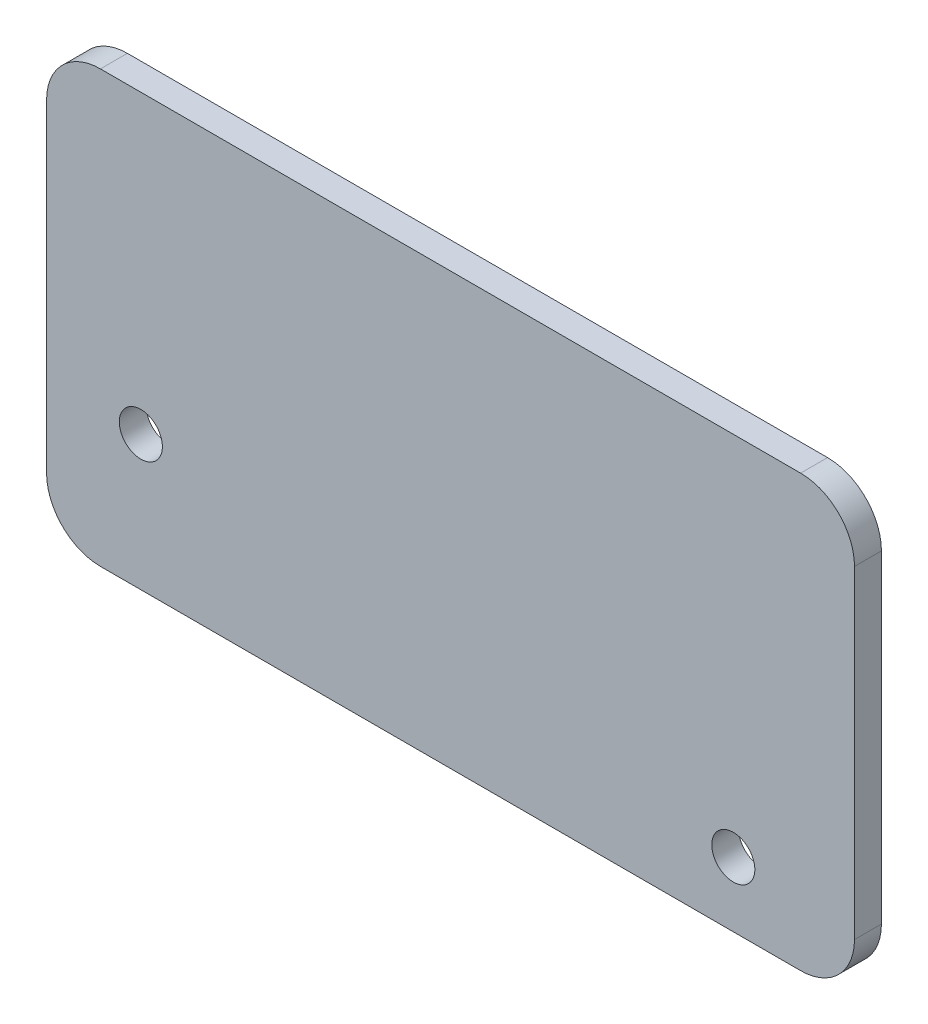
ISO-10303-21;
HEADER;
FILE_DESCRIPTION(('STEP AP214'),'2;1');
FILE_NAME('part.step','',(''),(''),'','','');
FILE_SCHEMA(('AUTOMOTIVE_DESIGN { 1 0 10303 214 1 1 1 1 }'));
ENDSEC;
DATA;
#1=APPLICATION_CONTEXT('core data for automotive mechanical design processes');
#2=APPLICATION_PROTOCOL_DEFINITION('international standard','automotive_design',2000,#1);
#3=PRODUCT_CONTEXT('',#1,'mechanical');
#4=PRODUCT('Part','Part','',(#3));
#5=PRODUCT_RELATED_PRODUCT_CATEGORY('part','',(#4));
#6=PRODUCT_DEFINITION_FORMATION('','',#4);
#7=PRODUCT_DEFINITION_CONTEXT('part definition',#1,'design');
#8=PRODUCT_DEFINITION('design','',#6,#7);
#9=PRODUCT_DEFINITION_SHAPE('','',#8);
#10=(LENGTH_UNIT() NAMED_UNIT(*) SI_UNIT(.MILLI.,.METRE.));
#11=(NAMED_UNIT(*) PLANE_ANGLE_UNIT() SI_UNIT($,.RADIAN.));
#12=(NAMED_UNIT(*) SI_UNIT($,.STERADIAN.) SOLID_ANGLE_UNIT());
#13=UNCERTAINTY_MEASURE_WITH_UNIT(LENGTH_MEASURE(1.E-05),#10,'distance_accuracy_value','');
#14=(GEOMETRIC_REPRESENTATION_CONTEXT(3) GLOBAL_UNCERTAINTY_ASSIGNED_CONTEXT((#13)) GLOBAL_UNIT_ASSIGNED_CONTEXT((#10,
#11,#12)) REPRESENTATION_CONTEXT('',''));
#15=CARTESIAN_POINT('',(0.,0.,0.));
#16=DIRECTION('',(0.,0.,1.));
#17=DIRECTION('',(1.,0.,0.));
#18=AXIS2_PLACEMENT_3D('',#15,#16,#17);
#19=CARTESIAN_POINT('',(65.,30.,5.));
#20=DIRECTION('',(0.,0.,1.));
#21=DIRECTION('',(1.,0.,0.));
#22=AXIS2_PLACEMENT_3D('',#19,#20,#21);
#23=PLANE('',#22);
#24=CARTESIAN_POINT('',(52.5,-28.,5.));
#25=DIRECTION('',(0.,0.,1.));
#26=DIRECTION('',(1.,0.,0.));
#27=AXIS2_PLACEMENT_3D('',#24,#25,#26);
#28=CIRCLE('',#27,4.00000000000001);
#29=CARTESIAN_POINT('',(56.5,-28.,5.));
#30=VERTEX_POINT('',#29);
#31=EDGE_CURVE('E136',#30,#30,#28,.T.);
#32=ORIENTED_EDGE('',*,*,#31,.F.);
#33=EDGE_LOOP('',(#32));
#34=FACE_BOUND('',#33,.T.);
#35=CARTESIAN_POINT('',(65.,30.,5.));
#36=DIRECTION('',(0.,0.,1.));
#37=DIRECTION('',(1.,0.,0.));
#38=AXIS2_PLACEMENT_3D('',#35,#36,#37);
#39=CIRCLE('',#38,9.99999999999999);
#40=CARTESIAN_POINT('',(75.,30.,5.));
#41=VERTEX_POINT('',#40);
#42=CARTESIAN_POINT('',(65.,40.,5.));
#43=VERTEX_POINT('',#42);
#44=EDGE_CURVE('E147',#41,#43,#39,.T.);
#45=ORIENTED_EDGE('',*,*,#44,.T.);
#46=DIRECTION('',(-1.,0.,0.));
#47=VECTOR('',#46,1.);
#48=CARTESIAN_POINT('',(-65.,40.,5.));
#49=LINE('',#48,#47);
#50=CARTESIAN_POINT('',(-65.,40.,5.));
#51=VERTEX_POINT('',#50);
#52=EDGE_CURVE('E95',#43,#51,#49,.T.);
#53=ORIENTED_EDGE('',*,*,#52,.T.);
#54=CARTESIAN_POINT('',(-65.,30.,5.));
#55=DIRECTION('',(0.,0.,1.));
#56=DIRECTION('',(-1.,0.,0.));
#57=AXIS2_PLACEMENT_3D('',#54,#55,#56);
#58=CIRCLE('',#57,9.99999999999999);
#59=CARTESIAN_POINT('',(-75.,30.,5.));
#60=VERTEX_POINT('',#59);
#61=EDGE_CURVE('E162',#51,#60,#58,.T.);
#62=ORIENTED_EDGE('',*,*,#61,.T.);
#63=DIRECTION('',(0.,-1.,0.));
#64=VECTOR('',#63,1.);
#65=CARTESIAN_POINT('',(-75.,30.,5.));
#66=LINE('',#65,#64);
#67=CARTESIAN_POINT('',(-75.,-30.,5.));
#68=VERTEX_POINT('',#67);
#69=EDGE_CURVE('E175',#60,#68,#66,.T.);
#70=ORIENTED_EDGE('',*,*,#69,.T.);
#71=CARTESIAN_POINT('',(-65.,-30.,5.));
#72=DIRECTION('',(0.,0.,1.));
#73=DIRECTION('',(-1.,0.,0.));
#74=AXIS2_PLACEMENT_3D('',#71,#72,#73);
#75=CIRCLE('',#74,9.99999999999999);
#76=CARTESIAN_POINT('',(-65.,-40.,5.));
#77=VERTEX_POINT('',#76);
#78=EDGE_CURVE('E114',#68,#77,#75,.T.);
#79=ORIENTED_EDGE('',*,*,#78,.T.);
#80=DIRECTION('',(1.,0.,0.));
#81=VECTOR('',#80,1.);
#82=CARTESIAN_POINT('',(-65.,-40.,5.));
#83=LINE('',#82,#81);
#84=CARTESIAN_POINT('',(65.,-40.,5.));
#85=VERTEX_POINT('',#84);
#86=EDGE_CURVE('E108',#77,#85,#83,.T.);
#87=ORIENTED_EDGE('',*,*,#86,.T.);
#88=CARTESIAN_POINT('',(65.,-30.,5.));
#89=DIRECTION('',(0.,0.,1.));
#90=DIRECTION('',(1.,0.,0.));
#91=AXIS2_PLACEMENT_3D('',#88,#89,#90);
#92=CIRCLE('',#91,10.);
#93=CARTESIAN_POINT('',(75.,-30.,5.));
#94=VERTEX_POINT('',#93);
#95=EDGE_CURVE('E112',#85,#94,#92,.T.);
#96=ORIENTED_EDGE('',*,*,#95,.T.);
#97=DIRECTION('',(0.,1.,0.));
#98=VECTOR('',#97,1.);
#99=CARTESIAN_POINT('',(75.,30.,5.));
#100=LINE('',#99,#98);
#101=EDGE_CURVE('E52',#94,#41,#100,.T.);
#102=ORIENTED_EDGE('',*,*,#101,.T.);
#103=EDGE_LOOP('',(#45,#53,#62,#70,#79,#87,#96,#102));
#104=FACE_BOUND('',#103,.T.);
#105=CARTESIAN_POINT('',(-57.500017929212,-14.9999999999999,5.));
#106=DIRECTION('',(0.,0.,1.));
#107=DIRECTION('',(1.,0.,0.));
#108=AXIS2_PLACEMENT_3D('',#105,#106,#107);
#109=CIRCLE('',#108,4.00000000000001);
#110=CARTESIAN_POINT('',(-53.500017929212,-14.9999999999999,5.));
#111=VERTEX_POINT('',#110);
#112=EDGE_CURVE('E184',#111,#111,#109,.T.);
#113=ORIENTED_EDGE('',*,*,#112,.F.);
#114=EDGE_LOOP('',(#113));
#115=FACE_BOUND('',#114,.T.);
#116=ADVANCED_FACE('F35',(#34,#104,#115),#23,.T.);
#117=CARTESIAN_POINT('',(65.,30.,0.));
#118=DIRECTION('',(0.,0.,1.));
#119=DIRECTION('',(1.,0.,0.));
#120=AXIS2_PLACEMENT_3D('',#117,#118,#119);
#121=PLANE('',#120);
#122=CARTESIAN_POINT('',(65.,30.,0.));
#123=DIRECTION('',(0.,0.,1.));
#124=DIRECTION('',(1.,0.,0.));
#125=AXIS2_PLACEMENT_3D('',#122,#123,#124);
#126=CIRCLE('',#125,9.99999999999999);
#127=CARTESIAN_POINT('',(75.,30.,0.));
#128=VERTEX_POINT('',#127);
#129=CARTESIAN_POINT('',(65.,40.,0.));
#130=VERTEX_POINT('',#129);
#131=EDGE_CURVE('E132',#128,#130,#126,.T.);
#132=ORIENTED_EDGE('',*,*,#131,.F.);
#133=DIRECTION('',(0.,1.,0.));
#134=VECTOR('',#133,1.);
#135=CARTESIAN_POINT('',(75.,30.,0.));
#136=LINE('',#135,#134);
#137=CARTESIAN_POINT('',(75.,-30.,0.));
#138=VERTEX_POINT('',#137);
#139=EDGE_CURVE('E87',#138,#128,#136,.T.);
#140=ORIENTED_EDGE('',*,*,#139,.F.);
#141=CARTESIAN_POINT('',(65.,-30.,0.));
#142=DIRECTION('',(0.,0.,1.));
#143=DIRECTION('',(1.,0.,0.));
#144=AXIS2_PLACEMENT_3D('',#141,#142,#143);
#145=CIRCLE('',#144,10.);
#146=CARTESIAN_POINT('',(65.,-40.,0.));
#147=VERTEX_POINT('',#146);
#148=EDGE_CURVE('E81',#147,#138,#145,.T.);
#149=ORIENTED_EDGE('',*,*,#148,.F.);
#150=DIRECTION('',(1.,0.,0.));
#151=VECTOR('',#150,1.);
#152=CARTESIAN_POINT('',(-65.,-40.,0.));
#153=LINE('',#152,#151);
#154=CARTESIAN_POINT('',(-65.,-40.,0.));
#155=VERTEX_POINT('',#154);
#156=EDGE_CURVE('E122',#155,#147,#153,.T.);
#157=ORIENTED_EDGE('',*,*,#156,.F.);
#158=CARTESIAN_POINT('',(-65.,-30.,0.));
#159=DIRECTION('',(0.,0.,1.));
#160=DIRECTION('',(-1.,0.,0.));
#161=AXIS2_PLACEMENT_3D('',#158,#159,#160);
#162=CIRCLE('',#161,9.99999999999999);
#163=CARTESIAN_POINT('',(-75.,-30.,0.));
#164=VERTEX_POINT('',#163);
#165=EDGE_CURVE('E142',#164,#155,#162,.T.);
#166=ORIENTED_EDGE('',*,*,#165,.F.);
#167=DIRECTION('',(0.,-1.,0.));
#168=VECTOR('',#167,1.);
#169=CARTESIAN_POINT('',(-75.,30.,0.));
#170=LINE('',#169,#168);
#171=CARTESIAN_POINT('',(-75.,30.,0.));
#172=VERTEX_POINT('',#171);
#173=EDGE_CURVE('E140',#172,#164,#170,.T.);
#174=ORIENTED_EDGE('',*,*,#173,.F.);
#175=CARTESIAN_POINT('',(-65.,30.,0.));
#176=DIRECTION('',(0.,0.,1.));
#177=DIRECTION('',(-1.,0.,0.));
#178=AXIS2_PLACEMENT_3D('',#175,#176,#177);
#179=CIRCLE('',#178,9.99999999999999);
#180=CARTESIAN_POINT('',(-65.,40.,0.));
#181=VERTEX_POINT('',#180);
#182=EDGE_CURVE('E138',#181,#172,#179,.T.);
#183=ORIENTED_EDGE('',*,*,#182,.F.);
#184=DIRECTION('',(-1.,0.,0.));
#185=VECTOR('',#184,1.);
#186=CARTESIAN_POINT('',(-65.,40.,0.));
#187=LINE('',#186,#185);
#188=EDGE_CURVE('E135',#130,#181,#187,.T.);
#189=ORIENTED_EDGE('',*,*,#188,.F.);
#190=EDGE_LOOP('',(#132,#140,#149,#157,#166,#174,#183,#189));
#191=FACE_BOUND('',#190,.T.);
#192=CARTESIAN_POINT('',(52.5,-28.,0.));
#193=DIRECTION('',(0.,0.,1.));
#194=DIRECTION('',(1.,0.,0.));
#195=AXIS2_PLACEMENT_3D('',#192,#193,#194);
#196=CIRCLE('',#195,4.00000000000001);
#197=CARTESIAN_POINT('',(56.5,-28.,0.));
#198=VERTEX_POINT('',#197);
#199=EDGE_CURVE('E181',#198,#198,#196,.T.);
#200=ORIENTED_EDGE('',*,*,#199,.T.);
#201=EDGE_LOOP('',(#200));
#202=FACE_BOUND('',#201,.T.);
#203=CARTESIAN_POINT('',(-57.500017929212,-14.9999999999999,0.));
#204=DIRECTION('',(0.,0.,1.));
#205=DIRECTION('',(1.,0.,0.));
#206=AXIS2_PLACEMENT_3D('',#203,#204,#205);
#207=CIRCLE('',#206,4.00000000000001);
#208=CARTESIAN_POINT('',(-53.500017929212,-14.9999999999999,0.));
#209=VERTEX_POINT('',#208);
#210=EDGE_CURVE('E187',#209,#209,#207,.T.);
#211=ORIENTED_EDGE('',*,*,#210,.T.);
#212=EDGE_LOOP('',(#211));
#213=FACE_BOUND('',#212,.T.);
#214=ADVANCED_FACE('F166',(#191,#202,#213),#121,.F.);
#215=CARTESIAN_POINT('',(65.,30.,5.));
#216=DIRECTION('',(0.,0.,-1.));
#217=DIRECTION('',(-1.,0.,0.));
#218=AXIS2_PLACEMENT_3D('',#215,#216,#217);
#219=CYLINDRICAL_SURFACE('',#218,9.99999999999999);
#220=ORIENTED_EDGE('',*,*,#131,.T.);
#221=DIRECTION('',(0.,0.,-1.));
#222=VECTOR('',#221,1.);
#223=CARTESIAN_POINT('',(65.,40.,5.));
#224=LINE('',#223,#222);
#225=EDGE_CURVE('E11',#43,#130,#224,.T.);
#226=ORIENTED_EDGE('',*,*,#225,.F.);
#227=ORIENTED_EDGE('',*,*,#44,.F.);
#228=DIRECTION('',(0.,0.,-1.));
#229=VECTOR('',#228,1.);
#230=CARTESIAN_POINT('',(75.,30.,5.));
#231=LINE('',#230,#229);
#232=EDGE_CURVE('E128',#41,#128,#231,.T.);
#233=ORIENTED_EDGE('',*,*,#232,.T.);
#234=EDGE_LOOP('',(#220,#226,#227,#233));
#235=FACE_BOUND('',#234,.T.);
#236=ADVANCED_FACE('F37',(#235),#219,.T.);
#237=CARTESIAN_POINT('',(-65.,40.,5.));
#238=DIRECTION('',(0.,-1.,0.));
#239=DIRECTION('',(1.,0.,0.));
#240=AXIS2_PLACEMENT_3D('',#237,#238,#239);
#241=PLANE('',#240);
#242=ORIENTED_EDGE('',*,*,#188,.T.);
#243=DIRECTION('',(0.,0.,-1.));
#244=VECTOR('',#243,1.);
#245=CARTESIAN_POINT('',(-65.,40.,5.));
#246=LINE('',#245,#244);
#247=EDGE_CURVE('E44',#51,#181,#246,.T.);
#248=ORIENTED_EDGE('',*,*,#247,.F.);
#249=ORIENTED_EDGE('',*,*,#52,.F.);
#250=ORIENTED_EDGE('',*,*,#225,.T.);
#251=EDGE_LOOP('',(#242,#248,#249,#250));
#252=FACE_BOUND('',#251,.T.);
#253=ADVANCED_FACE('F219',(#252),#241,.F.);
#254=CARTESIAN_POINT('',(-65.,30.,5.));
#255=DIRECTION('',(0.,0.,-1.));
#256=DIRECTION('',(-1.,0.,0.));
#257=AXIS2_PLACEMENT_3D('',#254,#255,#256);
#258=CYLINDRICAL_SURFACE('',#257,9.99999999999999);
#259=ORIENTED_EDGE('',*,*,#182,.T.);
#260=DIRECTION('',(0.,0.,-1.));
#261=VECTOR('',#260,1.);
#262=CARTESIAN_POINT('',(-75.,30.,5.));
#263=LINE('',#262,#261);
#264=EDGE_CURVE('E154',#60,#172,#263,.T.);
#265=ORIENTED_EDGE('',*,*,#264,.F.);
#266=ORIENTED_EDGE('',*,*,#61,.F.);
#267=ORIENTED_EDGE('',*,*,#247,.T.);
#268=EDGE_LOOP('',(#259,#265,#266,#267));
#269=FACE_BOUND('',#268,.T.);
#270=ADVANCED_FACE('F160',(#269),#258,.T.);
#271=CARTESIAN_POINT('',(-75.,30.,5.));
#272=DIRECTION('',(1.,0.,0.));
#273=DIRECTION('',(0.,0.,-1.));
#274=AXIS2_PLACEMENT_3D('',#271,#272,#273);
#275=PLANE('',#274);
#276=ORIENTED_EDGE('',*,*,#173,.T.);
#277=DIRECTION('',(0.,0.,-1.));
#278=VECTOR('',#277,1.);
#279=CARTESIAN_POINT('',(-75.,-30.,5.));
#280=LINE('',#279,#278);
#281=EDGE_CURVE('E151',#68,#164,#280,.T.);
#282=ORIENTED_EDGE('',*,*,#281,.F.);
#283=ORIENTED_EDGE('',*,*,#69,.F.);
#284=ORIENTED_EDGE('',*,*,#264,.T.);
#285=EDGE_LOOP('',(#276,#282,#283,#284));
#286=FACE_BOUND('',#285,.T.);
#287=ADVANCED_FACE('F171',(#286),#275,.F.);
#288=CARTESIAN_POINT('',(-65.,-30.,5.));
#289=DIRECTION('',(0.,0.,-1.));
#290=DIRECTION('',(-1.,0.,0.));
#291=AXIS2_PLACEMENT_3D('',#288,#289,#290);
#292=CYLINDRICAL_SURFACE('',#291,9.99999999999999);
#293=ORIENTED_EDGE('',*,*,#165,.T.);
#294=DIRECTION('',(0.,0.,-1.));
#295=VECTOR('',#294,1.);
#296=CARTESIAN_POINT('',(-65.,-40.,5.));
#297=LINE('',#296,#295);
#298=EDGE_CURVE('E123',#77,#155,#297,.T.);
#299=ORIENTED_EDGE('',*,*,#298,.F.);
#300=ORIENTED_EDGE('',*,*,#78,.F.);
#301=ORIENTED_EDGE('',*,*,#281,.T.);
#302=EDGE_LOOP('',(#293,#299,#300,#301));
#303=FACE_BOUND('',#302,.T.);
#304=ADVANCED_FACE('F174',(#303),#292,.T.);
#305=CARTESIAN_POINT('',(-65.,-40.,5.));
#306=DIRECTION('',(0.,1.,0.));
#307=DIRECTION('',(-1.,0.,0.));
#308=AXIS2_PLACEMENT_3D('',#305,#306,#307);
#309=PLANE('',#308);
#310=ORIENTED_EDGE('',*,*,#156,.T.);
#311=DIRECTION('',(0.,0.,-1.));
#312=VECTOR('',#311,1.);
#313=CARTESIAN_POINT('',(65.,-40.,5.));
#314=LINE('',#313,#312);
#315=EDGE_CURVE('E119',#85,#147,#314,.T.);
#316=ORIENTED_EDGE('',*,*,#315,.F.);
#317=ORIENTED_EDGE('',*,*,#86,.F.);
#318=ORIENTED_EDGE('',*,*,#298,.T.);
#319=EDGE_LOOP('',(#310,#316,#317,#318));
#320=FACE_BOUND('',#319,.T.);
#321=ADVANCED_FACE('F120',(#320),#309,.F.);
#322=CARTESIAN_POINT('',(65.,-30.,5.));
#323=DIRECTION('',(0.,0.,-1.));
#324=DIRECTION('',(-1.,0.,0.));
#325=AXIS2_PLACEMENT_3D('',#322,#323,#324);
#326=CYLINDRICAL_SURFACE('',#325,10.);
#327=ORIENTED_EDGE('',*,*,#148,.T.);
#328=DIRECTION('',(0.,0.,-1.));
#329=VECTOR('',#328,1.);
#330=CARTESIAN_POINT('',(75.,-30.,5.));
#331=LINE('',#330,#329);
#332=EDGE_CURVE('E124',#94,#138,#331,.T.);
#333=ORIENTED_EDGE('',*,*,#332,.F.);
#334=ORIENTED_EDGE('',*,*,#95,.F.);
#335=ORIENTED_EDGE('',*,*,#315,.T.);
#336=EDGE_LOOP('',(#327,#333,#334,#335));
#337=FACE_BOUND('',#336,.T.);
#338=ADVANCED_FACE('F126',(#337),#326,.T.);
#339=CARTESIAN_POINT('',(75.,30.,5.));
#340=DIRECTION('',(-1.,0.,0.));
#341=DIRECTION('',(0.,-1.,0.));
#342=AXIS2_PLACEMENT_3D('',#339,#340,#341);
#343=PLANE('',#342);
#344=ORIENTED_EDGE('',*,*,#139,.T.);
#345=ORIENTED_EDGE('',*,*,#232,.F.);
#346=ORIENTED_EDGE('',*,*,#101,.F.);
#347=ORIENTED_EDGE('',*,*,#332,.T.);
#348=EDGE_LOOP('',(#344,#345,#346,#347));
#349=FACE_BOUND('',#348,.T.);
#350=ADVANCED_FACE('F207',(#349),#343,.F.);
#351=CARTESIAN_POINT('',(52.5,-28.,5.));
#352=DIRECTION('',(0.,0.,-1.));
#353=DIRECTION('',(-1.,0.,0.));
#354=AXIS2_PLACEMENT_3D('',#351,#352,#353);
#355=CYLINDRICAL_SURFACE('',#354,4.00000000000001);
#356=ORIENTED_EDGE('',*,*,#31,.T.);
#357=EDGE_LOOP('',(#356));
#358=FACE_BOUND('',#357,.T.);
#359=ORIENTED_EDGE('',*,*,#199,.F.);
#360=EDGE_LOOP('',(#359));
#361=FACE_BOUND('',#360,.T.);
#362=ADVANCED_FACE('F204',(#358,#361),#355,.F.);
#363=CARTESIAN_POINT('',(-57.500017929212,-14.9999999999999,5.));
#364=DIRECTION('',(0.,0.,-1.));
#365=DIRECTION('',(-1.,0.,0.));
#366=AXIS2_PLACEMENT_3D('',#363,#364,#365);
#367=CYLINDRICAL_SURFACE('',#366,4.00000000000001);
#368=ORIENTED_EDGE('',*,*,#112,.T.);
#369=EDGE_LOOP('',(#368));
#370=FACE_BOUND('',#369,.T.);
#371=ORIENTED_EDGE('',*,*,#210,.F.);
#372=EDGE_LOOP('',(#371));
#373=FACE_BOUND('',#372,.T.);
#374=ADVANCED_FACE('F193',(#370,#373),#367,.F.);
#375=CLOSED_SHELL('',(#116,#214,#236,#253,#270,#287,#304,#321,#338,#350,#362,#374));
#376=MANIFOLD_SOLID_BREP('B2',#375);
#377=ADVANCED_BREP_SHAPE_REPRESENTATION('',(#18,#376),#14);
#378=SHAPE_DEFINITION_REPRESENTATION(#9,#377);
ENDSEC;
END-ISO-10303-21;
